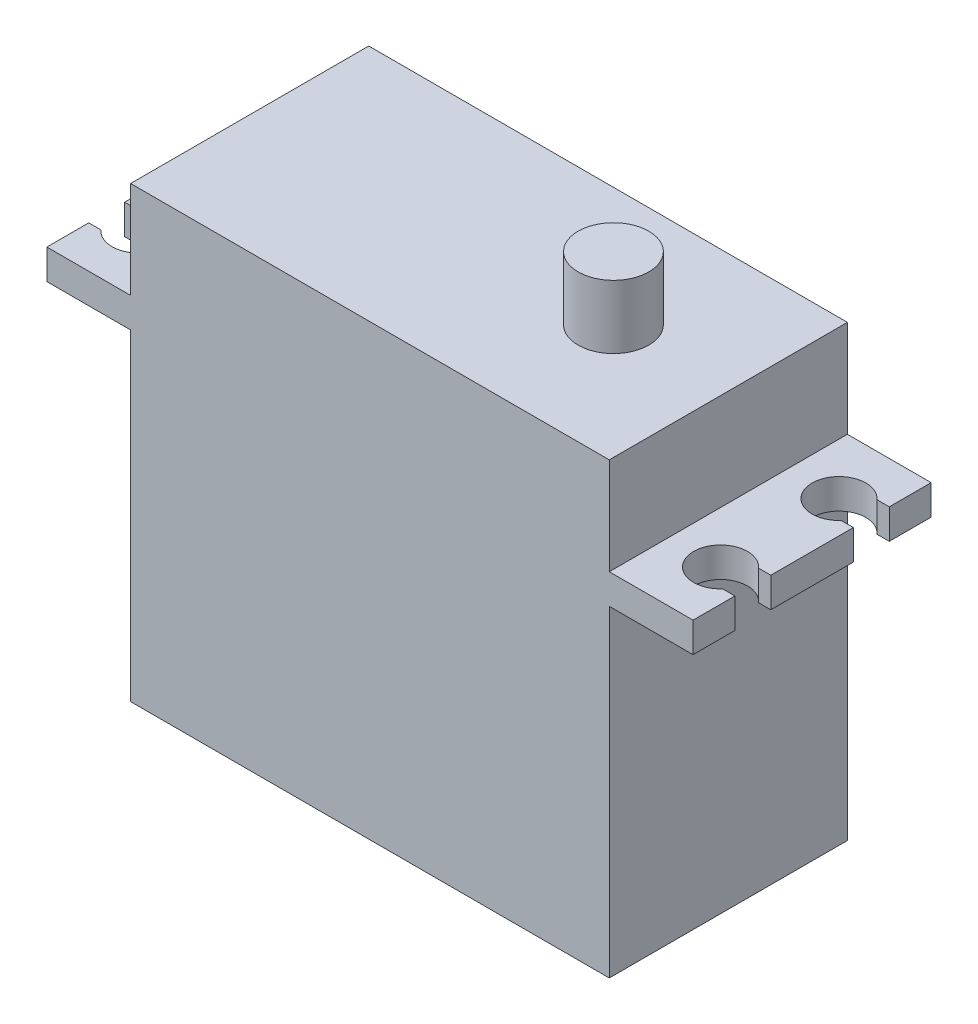
ISO-10303-21;
HEADER;
FILE_DESCRIPTION(('STEP AP214'),'2;1');
FILE_NAME('part.step','',(''),(''),'','','');
FILE_SCHEMA(('AUTOMOTIVE_DESIGN { 1 0 10303 214 1 1 1 1 }'));
ENDSEC;
DATA;
#1=APPLICATION_CONTEXT('core data for automotive mechanical design processes');
#2=APPLICATION_PROTOCOL_DEFINITION('international standard','automotive_design',2000,#1);
#3=PRODUCT_CONTEXT('',#1,'mechanical');
#4=PRODUCT('Part','Part','',(#3));
#5=PRODUCT_RELATED_PRODUCT_CATEGORY('part','',(#4));
#6=PRODUCT_DEFINITION_FORMATION('','',#4);
#7=PRODUCT_DEFINITION_CONTEXT('part definition',#1,'design');
#8=PRODUCT_DEFINITION('design','',#6,#7);
#9=PRODUCT_DEFINITION_SHAPE('','',#8);
#10=(LENGTH_UNIT() NAMED_UNIT(*) SI_UNIT(.MILLI.,.METRE.));
#11=(NAMED_UNIT(*) PLANE_ANGLE_UNIT() SI_UNIT($,.RADIAN.));
#12=(NAMED_UNIT(*) SI_UNIT($,.STERADIAN.) SOLID_ANGLE_UNIT());
#13=UNCERTAINTY_MEASURE_WITH_UNIT(LENGTH_MEASURE(1.E-05),#10,'distance_accuracy_value','');
#14=(GEOMETRIC_REPRESENTATION_CONTEXT(3) GLOBAL_UNCERTAINTY_ASSIGNED_CONTEXT((#13)) GLOBAL_UNIT_ASSIGNED_CONTEXT((#10,
#11,#12)) REPRESENTATION_CONTEXT('',''));
#15=CARTESIAN_POINT('',(0.,0.,0.));
#16=DIRECTION('',(0.,0.,1.));
#17=DIRECTION('',(1.,0.,0.));
#18=AXIS2_PLACEMENT_3D('',#15,#16,#17);
#19=CARTESIAN_POINT('',(10.4,42.8,0.));
#20=DIRECTION('',(0.,-1.,0.));
#21=DIRECTION('',(1.,0.,0.));
#22=AXIS2_PLACEMENT_3D('',#19,#20,#21);
#23=PLANE('',#22);
#24=CARTESIAN_POINT('',(10.4,42.8,0.));
#25=DIRECTION('',(0.,-1.,0.));
#26=DIRECTION('',(-1.,0.,0.));
#27=AXIS2_PLACEMENT_3D('',#24,#25,#26);
#28=CIRCLE('',#27,2.95);
#29=CARTESIAN_POINT('',(7.45,42.8,0.));
#30=VERTEX_POINT('',#29);
#31=EDGE_CURVE('E11',#30,#30,#28,.T.);
#32=ORIENTED_EDGE('',*,*,#31,.F.);
#33=EDGE_LOOP('',(#32));
#34=FACE_BOUND('',#33,.T.);
#35=ADVANCED_FACE('F51',(#34),#23,.F.);
#36=CARTESIAN_POINT('',(10.4,42.8,0.));
#37=DIRECTION('',(0.,1.,0.));
#38=DIRECTION('',(-1.,0.,0.));
#39=AXIS2_PLACEMENT_3D('',#36,#37,#38);
#40=CYLINDRICAL_SURFACE('',#39,2.95);
#41=ORIENTED_EDGE('',*,*,#31,.T.);
#42=EDGE_LOOP('',(#41));
#43=FACE_BOUND('',#42,.T.);
#44=CARTESIAN_POINT('',(10.4,25.,0.));
#45=DIRECTION('',(0.,-1.,0.));
#46=DIRECTION('',(-1.,0.,0.));
#47=AXIS2_PLACEMENT_3D('',#44,#45,#46);
#48=CIRCLE('',#47,2.95);
#49=CARTESIAN_POINT('',(7.45,25.,0.));
#50=VERTEX_POINT('',#49);
#51=EDGE_CURVE('E57',#50,#50,#48,.T.);
#52=ORIENTED_EDGE('',*,*,#51,.F.);
#53=EDGE_LOOP('',(#52));
#54=FACE_BOUND('',#53,.T.);
#55=ADVANCED_FACE('F83',(#43,#54),#40,.T.);
#56=CARTESIAN_POINT('',(13.35,25.,0.));
#57=DIRECTION('',(0.,-1.,0.));
#58=DIRECTION('',(1.,0.,0.));
#59=AXIS2_PLACEMENT_3D('',#56,#57,#58);
#60=PLANE('',#59);
#61=ORIENTED_EDGE('',*,*,#51,.T.);
#62=EDGE_LOOP('',(#61));
#63=FACE_BOUND('',#62,.T.);
#64=CARTESIAN_POINT('',(10.4,25.,0.));
#65=DIRECTION('',(0.,-1.,0.));
#66=DIRECTION('',(-1.,0.,0.));
#67=AXIS2_PLACEMENT_3D('',#64,#65,#66);
#68=CIRCLE('',#67,6.);
#69=CARTESIAN_POINT('',(4.4,25.,0.));
#70=VERTEX_POINT('',#69);
#71=EDGE_CURVE('E61',#70,#70,#68,.T.);
#72=ORIENTED_EDGE('',*,*,#71,.F.);
#73=EDGE_LOOP('',(#72));
#74=FACE_BOUND('',#73,.T.);
#75=ADVANCED_FACE('F75',(#63,#74),#60,.F.);
#76=CARTESIAN_POINT('',(10.4,42.8,0.));
#77=DIRECTION('',(0.,1.,0.));
#78=DIRECTION('',(-1.,0.,0.));
#79=AXIS2_PLACEMENT_3D('',#76,#77,#78);
#80=CYLINDRICAL_SURFACE('',#79,6.);
#81=ORIENTED_EDGE('',*,*,#71,.T.);
#82=EDGE_LOOP('',(#81));
#83=FACE_BOUND('',#82,.T.);
#84=CARTESIAN_POINT('',(10.4,3.,0.));
#85=DIRECTION('',(0.,-1.,0.));
#86=DIRECTION('',(-1.,0.,0.));
#87=AXIS2_PLACEMENT_3D('',#84,#85,#86);
#88=CIRCLE('',#87,6.);
#89=CARTESIAN_POINT('',(4.4,3.,0.));
#90=VERTEX_POINT('',#89);
#91=EDGE_CURVE('E65',#90,#90,#88,.T.);
#92=ORIENTED_EDGE('',*,*,#91,.F.);
#93=EDGE_LOOP('',(#92));
#94=FACE_BOUND('',#93,.T.);
#95=ADVANCED_FACE('F73',(#83,#94),#80,.T.);
#96=CARTESIAN_POINT('',(16.4,3.,0.));
#97=DIRECTION('',(0.,1.,0.));
#98=DIRECTION('',(-1.,0.,0.));
#99=AXIS2_PLACEMENT_3D('',#96,#97,#98);
#100=PLANE('',#99);
#101=ORIENTED_EDGE('',*,*,#91,.T.);
#102=EDGE_LOOP('',(#101));
#103=FACE_BOUND('',#102,.T.);
#104=ADVANCED_FACE('F71',(#103),#100,.F.);
#105=CLOSED_SHELL('',(#35,#55,#75,#95,#104));
#106=MANIFOLD_SOLID_BREP('B2',#105);
#107=CARTESIAN_POINT('',(-24.3,29.4,4.95));
#108=DIRECTION('',(0.,1.,0.));
#109=DIRECTION('',(0.,0.,-1.));
#110=AXIS2_PLACEMENT_3D('',#107,#108,#109);
#111=PLANE('',#110);
#112=DIRECTION('',(0.,0.,1.));
#113=VECTOR('',#112,1.);
#114=CARTESIAN_POINT('',(20.,29.4,-9.95));
#115=LINE('',#114,#113);
#116=CARTESIAN_POINT('',(20.,29.4,-9.95));
#117=VERTEX_POINT('',#116);
#118=CARTESIAN_POINT('',(20.,29.4,9.95));
#119=VERTEX_POINT('',#118);
#120=EDGE_CURVE('E543',#117,#119,#115,.T.);
#121=ORIENTED_EDGE('',*,*,#120,.T.);
#122=DIRECTION('',(-1.,0.,0.));
#123=VECTOR('',#122,1.);
#124=CARTESIAN_POINT('',(-27.,29.4,9.95));
#125=LINE('',#124,#123);
#126=CARTESIAN_POINT('',(27.,29.4,9.95));
#127=VERTEX_POINT('',#126);
#128=EDGE_CURVE('E328',#127,#119,#125,.T.);
#129=ORIENTED_EDGE('',*,*,#128,.F.);
#130=DIRECTION('',(0.,0.,1.));
#131=VECTOR('',#130,1.);
#132=CARTESIAN_POINT('',(27.,29.4,6.45));
#133=LINE('',#132,#131);
#134=CARTESIAN_POINT('',(27.,29.4,6.45));
#135=VERTEX_POINT('',#134);
#136=EDGE_CURVE('E339',#135,#127,#133,.T.);
#137=ORIENTED_EDGE('',*,*,#136,.F.);
#138=DIRECTION('',(1.,0.,0.));
#139=VECTOR('',#138,1.);
#140=CARTESIAN_POINT('',(25.9770509831248,29.4,6.45));
#141=LINE('',#140,#139);
#142=CARTESIAN_POINT('',(25.9770509831248,29.4,6.45));
#143=VERTEX_POINT('',#142);
#144=EDGE_CURVE('E396',#143,#135,#141,.T.);
#145=ORIENTED_EDGE('',*,*,#144,.F.);
#146=CARTESIAN_POINT('',(24.3,29.4,4.95));
#147=DIRECTION('',(0.,1.,0.));
#148=DIRECTION('',(0.,0.,-1.));
#149=AXIS2_PLACEMENT_3D('',#146,#147,#148);
#150=CIRCLE('',#149,2.25);
#151=CARTESIAN_POINT('',(25.9770509831248,29.4,3.45));
#152=VERTEX_POINT('',#151);
#153=EDGE_CURVE('E393',#152,#143,#150,.T.);
#154=ORIENTED_EDGE('',*,*,#153,.F.);
#155=DIRECTION('',(-1.,0.,0.));
#156=VECTOR('',#155,1.);
#157=CARTESIAN_POINT('',(25.9770509831248,29.4,3.45));
#158=LINE('',#157,#156);
#159=CARTESIAN_POINT('',(27.,29.4,3.45));
#160=VERTEX_POINT('',#159);
#161=EDGE_CURVE('E390',#160,#152,#158,.T.);
#162=ORIENTED_EDGE('',*,*,#161,.F.);
#163=DIRECTION('',(0.,0.,1.));
#164=VECTOR('',#163,1.);
#165=CARTESIAN_POINT('',(27.,29.4,-3.45));
#166=LINE('',#165,#164);
#167=CARTESIAN_POINT('',(27.,29.4,-3.45));
#168=VERTEX_POINT('',#167);
#169=EDGE_CURVE('E387',#168,#160,#166,.T.);
#170=ORIENTED_EDGE('',*,*,#169,.F.);
#171=DIRECTION('',(1.,0.,0.));
#172=VECTOR('',#171,1.);
#173=CARTESIAN_POINT('',(25.9770509831248,29.4,-3.45));
#174=LINE('',#173,#172);
#175=CARTESIAN_POINT('',(25.9770509831248,29.4,-3.45));
#176=VERTEX_POINT('',#175);
#177=EDGE_CURVE('E384',#176,#168,#174,.T.);
#178=ORIENTED_EDGE('',*,*,#177,.F.);
#179=CARTESIAN_POINT('',(24.3,29.4,-4.95));
#180=DIRECTION('',(0.,1.,0.));
#181=DIRECTION('',(0.,0.,-1.));
#182=AXIS2_PLACEMENT_3D('',#179,#180,#181);
#183=CIRCLE('',#182,2.25);
#184=CARTESIAN_POINT('',(25.9770509831248,29.4,-6.45));
#185=VERTEX_POINT('',#184);
#186=EDGE_CURVE('E381',#185,#176,#183,.T.);
#187=ORIENTED_EDGE('',*,*,#186,.F.);
#188=DIRECTION('',(-1.,0.,0.));
#189=VECTOR('',#188,1.);
#190=CARTESIAN_POINT('',(25.9770509831248,29.4,-6.45));
#191=LINE('',#190,#189);
#192=CARTESIAN_POINT('',(27.,29.4,-6.45));
#193=VERTEX_POINT('',#192);
#194=EDGE_CURVE('E378',#193,#185,#191,.T.);
#195=ORIENTED_EDGE('',*,*,#194,.F.);
#196=DIRECTION('',(0.,0.,1.));
#197=VECTOR('',#196,1.);
#198=CARTESIAN_POINT('',(27.,29.4,-9.95));
#199=LINE('',#198,#197);
#200=CARTESIAN_POINT('',(27.,29.4,-9.95));
#201=VERTEX_POINT('',#200);
#202=EDGE_CURVE('E375',#201,#193,#199,.T.);
#203=ORIENTED_EDGE('',*,*,#202,.F.);
#204=DIRECTION('',(1.,0.,0.));
#205=VECTOR('',#204,1.);
#206=CARTESIAN_POINT('',(-27.,29.4,-9.95));
#207=LINE('',#206,#205);
#208=EDGE_CURVE('E371',#117,#201,#207,.T.);
#209=ORIENTED_EDGE('',*,*,#208,.F.);
#210=EDGE_LOOP('',(#121,#129,#137,#145,#154,#162,#170,#178,#187,#195,#203,#209));
#211=FACE_BOUND('',#210,.T.);
#212=ADVANCED_FACE('F122',(#211),#111,.T.);
#213=CARTESIAN_POINT('',(20.,26.9,-9.95));
#214=DIRECTION('',(-1.,0.,0.));
#215=DIRECTION('',(0.,0.,-1.));
#216=AXIS2_PLACEMENT_3D('',#213,#214,#215);
#217=PLANE('',#216);
#218=DIRECTION('',(0.,0.,1.));
#219=VECTOR('',#218,1.);
#220=CARTESIAN_POINT('',(20.,0.,-9.95));
#221=LINE('',#220,#219);
#222=CARTESIAN_POINT('',(20.,0.,-9.95));
#223=VERTEX_POINT('',#222);
#224=CARTESIAN_POINT('',(20.,0.,9.95));
#225=VERTEX_POINT('',#224);
#226=EDGE_CURVE('E497',#223,#225,#221,.T.);
#227=ORIENTED_EDGE('',*,*,#226,.F.);
#228=DIRECTION('',(0.,-1.,0.));
#229=VECTOR('',#228,1.);
#230=CARTESIAN_POINT('',(20.,26.9,-9.95));
#231=LINE('',#230,#229);
#232=CARTESIAN_POINT('',(20.,26.9,-9.95));
#233=VERTEX_POINT('',#232);
#234=EDGE_CURVE('E505',#233,#223,#231,.T.);
#235=ORIENTED_EDGE('',*,*,#234,.F.);
#236=DIRECTION('',(0.,0.,1.));
#237=VECTOR('',#236,1.);
#238=CARTESIAN_POINT('',(20.,26.9,-9.95));
#239=LINE('',#238,#237);
#240=CARTESIAN_POINT('',(20.,26.9,9.95));
#241=VERTEX_POINT('',#240);
#242=EDGE_CURVE('E498',#233,#241,#239,.T.);
#243=ORIENTED_EDGE('',*,*,#242,.T.);
#244=DIRECTION('',(0.,-1.,0.));
#245=VECTOR('',#244,1.);
#246=CARTESIAN_POINT('',(20.,26.9,9.95));
#247=LINE('',#246,#245);
#248=EDGE_CURVE('E49',#241,#225,#247,.T.);
#249=ORIENTED_EDGE('',*,*,#248,.T.);
#250=EDGE_LOOP('',(#227,#235,#243,#249));
#251=FACE_BOUND('',#250,.T.);
#252=ADVANCED_FACE('F124',(#251),#217,.F.);
#253=CARTESIAN_POINT('',(-20.,26.9,9.95));
#254=DIRECTION('',(0.,0.,-1.));
#255=DIRECTION('',(1.,0.,0.));
#256=AXIS2_PLACEMENT_3D('',#253,#254,#255);
#257=PLANE('',#256);
#258=DIRECTION('',(-1.,0.,0.));
#259=VECTOR('',#258,1.);
#260=CARTESIAN_POINT('',(-20.,0.,9.95));
#261=LINE('',#260,#259);
#262=CARTESIAN_POINT('',(-20.,0.,9.95));
#263=VERTEX_POINT('',#262);
#264=EDGE_CURVE('E508',#225,#263,#261,.T.);
#265=ORIENTED_EDGE('',*,*,#264,.F.);
#266=ORIENTED_EDGE('',*,*,#248,.F.);
#267=DIRECTION('',(-1.,0.,0.));
#268=VECTOR('',#267,1.);
#269=CARTESIAN_POINT('',(-27.,26.9,9.95));
#270=LINE('',#269,#268);
#271=CARTESIAN_POINT('',(27.,26.9,9.95));
#272=VERTEX_POINT('',#271);
#273=EDGE_CURVE('E400',#272,#241,#270,.T.);
#274=ORIENTED_EDGE('',*,*,#273,.F.);
#275=DIRECTION('',(0.,-1.,0.));
#276=VECTOR('',#275,1.);
#277=CARTESIAN_POINT('',(27.,29.4,9.95));
#278=LINE('',#277,#276);
#279=EDGE_CURVE('E494',#127,#272,#278,.T.);
#280=ORIENTED_EDGE('',*,*,#279,.F.);
#281=ORIENTED_EDGE('',*,*,#128,.T.);
#282=DIRECTION('',(0.,-1.,0.));
#283=VECTOR('',#282,1.);
#284=CARTESIAN_POINT('',(20.,37.5,9.95));
#285=LINE('',#284,#283);
#286=CARTESIAN_POINT('',(20.,37.5,9.95));
#287=VERTEX_POINT('',#286);
#288=EDGE_CURVE('E314',#287,#119,#285,.T.);
#289=ORIENTED_EDGE('',*,*,#288,.F.);
#290=DIRECTION('',(-1.,0.,0.));
#291=VECTOR('',#290,1.);
#292=CARTESIAN_POINT('',(-20.,37.5,9.95));
#293=LINE('',#292,#291);
#294=CARTESIAN_POINT('',(-20.,37.5,9.95));
#295=VERTEX_POINT('',#294);
#296=EDGE_CURVE('E318',#287,#295,#293,.T.);
#297=ORIENTED_EDGE('',*,*,#296,.T.);
#298=DIRECTION('',(0.,-1.,0.));
#299=VECTOR('',#298,1.);
#300=CARTESIAN_POINT('',(-20.,37.5,9.95));
#301=LINE('',#300,#299);
#302=CARTESIAN_POINT('',(-20.,29.4,9.95));
#303=VERTEX_POINT('',#302);
#304=EDGE_CURVE('E331',#295,#303,#301,.T.);
#305=ORIENTED_EDGE('',*,*,#304,.T.);
#306=CARTESIAN_POINT('',(-27.,29.4,9.95));
#307=VERTEX_POINT('',#306);
#308=EDGE_CURVE('E342',#303,#307,#125,.T.);
#309=ORIENTED_EDGE('',*,*,#308,.T.);
#310=DIRECTION('',(0.,-1.,0.));
#311=VECTOR('',#310,1.);
#312=CARTESIAN_POINT('',(-27.,29.4,9.95));
#313=LINE('',#312,#311);
#314=CARTESIAN_POINT('',(-27.,26.9,9.95));
#315=VERTEX_POINT('',#314);
#316=EDGE_CURVE('E491',#307,#315,#313,.T.);
#317=ORIENTED_EDGE('',*,*,#316,.T.);
#318=CARTESIAN_POINT('',(-20.,26.9,9.95));
#319=VERTEX_POINT('',#318);
#320=EDGE_CURVE('E333',#319,#315,#270,.T.);
#321=ORIENTED_EDGE('',*,*,#320,.F.);
#322=DIRECTION('',(0.,-1.,0.));
#323=VECTOR('',#322,1.);
#324=CARTESIAN_POINT('',(-20.,26.9,9.95));
#325=LINE('',#324,#323);
#326=EDGE_CURVE('E131',#319,#263,#325,.T.);
#327=ORIENTED_EDGE('',*,*,#326,.T.);
#328=EDGE_LOOP('',(#265,#266,#274,#280,#281,#289,#297,#305,#309,#317,#321,#327));
#329=FACE_BOUND('',#328,.T.);
#330=ADVANCED_FACE('F326',(#329),#257,.F.);
#331=CARTESIAN_POINT('',(-20.,26.9,-9.95));
#332=DIRECTION('',(1.,0.,0.));
#333=DIRECTION('',(0.,0.,1.));
#334=AXIS2_PLACEMENT_3D('',#331,#332,#333);
#335=PLANE('',#334);
#336=DIRECTION('',(0.,0.,-1.));
#337=VECTOR('',#336,1.);
#338=CARTESIAN_POINT('',(-20.,0.,-9.95));
#339=LINE('',#338,#337);
#340=CARTESIAN_POINT('',(-20.,0.,-9.95));
#341=VERTEX_POINT('',#340);
#342=EDGE_CURVE('E511',#263,#341,#339,.T.);
#343=ORIENTED_EDGE('',*,*,#342,.F.);
#344=ORIENTED_EDGE('',*,*,#326,.F.);
#345=DIRECTION('',(0.,0.,-1.));
#346=VECTOR('',#345,1.);
#347=CARTESIAN_POINT('',(-20.,26.9,-9.95));
#348=LINE('',#347,#346);
#349=CARTESIAN_POINT('',(-20.,26.9,-9.95));
#350=VERTEX_POINT('',#349);
#351=EDGE_CURVE('E501',#319,#350,#348,.T.);
#352=ORIENTED_EDGE('',*,*,#351,.T.);
#353=DIRECTION('',(0.,-1.,0.));
#354=VECTOR('',#353,1.);
#355=CARTESIAN_POINT('',(-20.,26.9,-9.95));
#356=LINE('',#355,#354);
#357=EDGE_CURVE('E517',#350,#341,#356,.T.);
#358=ORIENTED_EDGE('',*,*,#357,.T.);
#359=EDGE_LOOP('',(#343,#344,#352,#358));
#360=FACE_BOUND('',#359,.T.);
#361=ADVANCED_FACE('F571',(#360),#335,.F.);
#362=CARTESIAN_POINT('',(-20.,26.9,-9.95));
#363=DIRECTION('',(0.,0.,1.));
#364=DIRECTION('',(-1.,0.,0.));
#365=AXIS2_PLACEMENT_3D('',#362,#363,#364);
#366=PLANE('',#365);
#367=DIRECTION('',(1.,0.,0.));
#368=VECTOR('',#367,1.);
#369=CARTESIAN_POINT('',(-20.,0.,-9.95));
#370=LINE('',#369,#368);
#371=EDGE_CURVE('E502',#341,#223,#370,.T.);
#372=ORIENTED_EDGE('',*,*,#371,.F.);
#373=ORIENTED_EDGE('',*,*,#357,.F.);
#374=DIRECTION('',(1.,0.,0.));
#375=VECTOR('',#374,1.);
#376=CARTESIAN_POINT('',(-27.,26.9,-9.95));
#377=LINE('',#376,#375);
#378=CARTESIAN_POINT('',(-27.,26.9,-9.95));
#379=VERTEX_POINT('',#378);
#380=EDGE_CURVE('E429',#379,#350,#377,.T.);
#381=ORIENTED_EDGE('',*,*,#380,.F.);
#382=DIRECTION('',(0.,-1.,0.));
#383=VECTOR('',#382,1.);
#384=CARTESIAN_POINT('',(-27.,29.4,-9.95));
#385=LINE('',#384,#383);
#386=CARTESIAN_POINT('',(-27.,29.4,-9.95));
#387=VERTEX_POINT('',#386);
#388=EDGE_CURVE('E472',#387,#379,#385,.T.);
#389=ORIENTED_EDGE('',*,*,#388,.F.);
#390=CARTESIAN_POINT('',(-20.,29.4,-9.95));
#391=VERTEX_POINT('',#390);
#392=EDGE_CURVE('E372',#387,#391,#207,.T.);
#393=ORIENTED_EDGE('',*,*,#392,.T.);
#394=DIRECTION('',(0.,-1.,0.));
#395=VECTOR('',#394,1.);
#396=CARTESIAN_POINT('',(-20.,37.5,-9.95));
#397=LINE('',#396,#395);
#398=CARTESIAN_POINT('',(-20.,37.5,-9.95));
#399=VERTEX_POINT('',#398);
#400=EDGE_CURVE('E335',#399,#391,#397,.T.);
#401=ORIENTED_EDGE('',*,*,#400,.F.);
#402=DIRECTION('',(1.,0.,0.));
#403=VECTOR('',#402,1.);
#404=CARTESIAN_POINT('',(-20.,37.5,-9.95));
#405=LINE('',#404,#403);
#406=CARTESIAN_POINT('',(20.,37.5,-9.95));
#407=VERTEX_POINT('',#406);
#408=EDGE_CURVE('E550',#399,#407,#405,.T.);
#409=ORIENTED_EDGE('',*,*,#408,.T.);
#410=DIRECTION('',(0.,-1.,0.));
#411=VECTOR('',#410,1.);
#412=CARTESIAN_POINT('',(20.,37.5,-9.95));
#413=LINE('',#412,#411);
#414=EDGE_CURVE('E138',#407,#117,#413,.T.);
#415=ORIENTED_EDGE('',*,*,#414,.T.);
#416=ORIENTED_EDGE('',*,*,#208,.T.);
#417=DIRECTION('',(0.,-1.,0.));
#418=VECTOR('',#417,1.);
#419=CARTESIAN_POINT('',(27.,29.4,-9.95));
#420=LINE('',#419,#418);
#421=CARTESIAN_POINT('',(27.,26.9,-9.95));
#422=VERTEX_POINT('',#421);
#423=EDGE_CURVE('E469',#201,#422,#420,.T.);
#424=ORIENTED_EDGE('',*,*,#423,.T.);
#425=EDGE_CURVE('E428',#233,#422,#377,.T.);
#426=ORIENTED_EDGE('',*,*,#425,.F.);
#427=ORIENTED_EDGE('',*,*,#234,.T.);
#428=EDGE_LOOP('',(#372,#373,#381,#389,#393,#401,#409,#415,#416,#424,#426,#427));
#429=FACE_BOUND('',#428,.T.);
#430=ADVANCED_FACE('F557',(#429),#366,.F.);
#431=CARTESIAN_POINT('',(0.,0.,0.));
#432=DIRECTION('',(0.,-1.,0.));
#433=DIRECTION('',(0.,0.,1.));
#434=AXIS2_PLACEMENT_3D('',#431,#432,#433);
#435=PLANE('',#434);
#436=ORIENTED_EDGE('',*,*,#226,.T.);
#437=ORIENTED_EDGE('',*,*,#264,.T.);
#438=ORIENTED_EDGE('',*,*,#342,.T.);
#439=ORIENTED_EDGE('',*,*,#371,.T.);
#440=EDGE_LOOP('',(#436,#437,#438,#439));
#441=FACE_BOUND('',#440,.T.);
#442=ADVANCED_FACE('F527',(#441),#435,.T.);
#443=CARTESIAN_POINT('',(-24.3,26.9,4.95));
#444=DIRECTION('',(0.,1.,0.));
#445=DIRECTION('',(0.,0.,-1.));
#446=AXIS2_PLACEMENT_3D('',#443,#444,#445);
#447=PLANE('',#446);
#448=ORIENTED_EDGE('',*,*,#425,.T.);
#449=DIRECTION('',(0.,0.,1.));
#450=VECTOR('',#449,1.);
#451=CARTESIAN_POINT('',(27.,26.9,-9.95));
#452=LINE('',#451,#450);
#453=CARTESIAN_POINT('',(27.,26.9,-6.45));
#454=VERTEX_POINT('',#453);
#455=EDGE_CURVE('E431',#422,#454,#452,.T.);
#456=ORIENTED_EDGE('',*,*,#455,.T.);
#457=DIRECTION('',(-1.,0.,0.));
#458=VECTOR('',#457,1.);
#459=CARTESIAN_POINT('',(25.9770509831248,26.9,-6.45));
#460=LINE('',#459,#458);
#461=CARTESIAN_POINT('',(25.9770509831248,26.9,-6.45));
#462=VERTEX_POINT('',#461);
#463=EDGE_CURVE('E434',#454,#462,#460,.T.);
#464=ORIENTED_EDGE('',*,*,#463,.T.);
#465=CARTESIAN_POINT('',(24.3,26.9,-4.95));
#466=DIRECTION('',(0.,1.,0.));
#467=DIRECTION('',(0.,0.,-1.));
#468=AXIS2_PLACEMENT_3D('',#465,#466,#467);
#469=CIRCLE('',#468,2.25);
#470=CARTESIAN_POINT('',(25.9770509831248,26.9,-3.45));
#471=VERTEX_POINT('',#470);
#472=EDGE_CURVE('E437',#462,#471,#469,.T.);
#473=ORIENTED_EDGE('',*,*,#472,.T.);
#474=DIRECTION('',(1.,0.,0.));
#475=VECTOR('',#474,1.);
#476=CARTESIAN_POINT('',(25.9770509831248,26.9,-3.45));
#477=LINE('',#476,#475);
#478=CARTESIAN_POINT('',(27.,26.9,-3.45));
#479=VERTEX_POINT('',#478);
#480=EDGE_CURVE('E440',#471,#479,#477,.T.);
#481=ORIENTED_EDGE('',*,*,#480,.T.);
#482=DIRECTION('',(0.,0.,1.));
#483=VECTOR('',#482,1.);
#484=CARTESIAN_POINT('',(27.,26.9,-3.45));
#485=LINE('',#484,#483);
#486=CARTESIAN_POINT('',(27.,26.9,3.45));
#487=VERTEX_POINT('',#486);
#488=EDGE_CURVE('E443',#479,#487,#485,.T.);
#489=ORIENTED_EDGE('',*,*,#488,.T.);
#490=DIRECTION('',(-1.,0.,0.));
#491=VECTOR('',#490,1.);
#492=CARTESIAN_POINT('',(25.9770509831248,26.9,3.45));
#493=LINE('',#492,#491);
#494=CARTESIAN_POINT('',(25.9770509831248,26.9,3.45));
#495=VERTEX_POINT('',#494);
#496=EDGE_CURVE('E446',#487,#495,#493,.T.);
#497=ORIENTED_EDGE('',*,*,#496,.T.);
#498=CARTESIAN_POINT('',(24.3,26.9,4.95));
#499=DIRECTION('',(0.,1.,0.));
#500=DIRECTION('',(0.,0.,-1.));
#501=AXIS2_PLACEMENT_3D('',#498,#499,#500);
#502=CIRCLE('',#501,2.25);
#503=CARTESIAN_POINT('',(25.9770509831248,26.9,6.45));
#504=VERTEX_POINT('',#503);
#505=EDGE_CURVE('E449',#495,#504,#502,.T.);
#506=ORIENTED_EDGE('',*,*,#505,.T.);
#507=DIRECTION('',(1.,0.,0.));
#508=VECTOR('',#507,1.);
#509=CARTESIAN_POINT('',(25.9770509831248,26.9,6.45));
#510=LINE('',#509,#508);
#511=CARTESIAN_POINT('',(27.,26.9,6.45));
#512=VERTEX_POINT('',#511);
#513=EDGE_CURVE('E343',#504,#512,#510,.T.);
#514=ORIENTED_EDGE('',*,*,#513,.T.);
#515=DIRECTION('',(0.,0.,1.));
#516=VECTOR('',#515,1.);
#517=CARTESIAN_POINT('',(27.,26.9,6.45));
#518=LINE('',#517,#516);
#519=EDGE_CURVE('E330',#512,#272,#518,.T.);
#520=ORIENTED_EDGE('',*,*,#519,.T.);
#521=ORIENTED_EDGE('',*,*,#273,.T.);
#522=ORIENTED_EDGE('',*,*,#242,.F.);
#523=EDGE_LOOP('',(#448,#456,#464,#473,#481,#489,#497,#506,#514,#520,#521,#522));
#524=FACE_BOUND('',#523,.T.);
#525=ADVANCED_FACE('F535',(#524),#447,.F.);
#526=ORIENTED_EDGE('',*,*,#320,.T.);
#527=DIRECTION('',(0.,0.,-1.));
#528=VECTOR('',#527,1.);
#529=CARTESIAN_POINT('',(-27.,26.9,6.45));
#530=LINE('',#529,#528);
#531=CARTESIAN_POINT('',(-27.,26.9,6.45));
#532=VERTEX_POINT('',#531);
#533=EDGE_CURVE('E402',#315,#532,#530,.T.);
#534=ORIENTED_EDGE('',*,*,#533,.T.);
#535=DIRECTION('',(1.,0.,0.));
#536=VECTOR('',#535,1.);
#537=CARTESIAN_POINT('',(-25.9770509831249,26.9,6.45));
#538=LINE('',#537,#536);
#539=CARTESIAN_POINT('',(-25.9770509831249,26.9,6.45));
#540=VERTEX_POINT('',#539);
#541=EDGE_CURVE('E405',#532,#540,#538,.T.);
#542=ORIENTED_EDGE('',*,*,#541,.T.);
#543=CARTESIAN_POINT('',(-24.3,26.9,4.95));
#544=DIRECTION('',(0.,1.,0.));
#545=DIRECTION('',(0.,0.,-1.));
#546=AXIS2_PLACEMENT_3D('',#543,#544,#545);
#547=CIRCLE('',#546,2.25);
#548=CARTESIAN_POINT('',(-25.9770509831249,26.9,3.45000000000001));
#549=VERTEX_POINT('',#548);
#550=EDGE_CURVE('E408',#540,#549,#547,.T.);
#551=ORIENTED_EDGE('',*,*,#550,.T.);
#552=DIRECTION('',(-1.,0.,0.));
#553=VECTOR('',#552,1.);
#554=CARTESIAN_POINT('',(-25.9770509831249,26.9,3.45000000000001));
#555=LINE('',#554,#553);
#556=CARTESIAN_POINT('',(-27.,26.9,3.45000000000001));
#557=VERTEX_POINT('',#556);
#558=EDGE_CURVE('E411',#549,#557,#555,.T.);
#559=ORIENTED_EDGE('',*,*,#558,.T.);
#560=DIRECTION('',(0.,0.,-1.));
#561=VECTOR('',#560,1.);
#562=CARTESIAN_POINT('',(-27.,26.9,-3.45));
#563=LINE('',#562,#561);
#564=CARTESIAN_POINT('',(-27.,26.9,-3.45));
#565=VERTEX_POINT('',#564);
#566=EDGE_CURVE('E414',#557,#565,#563,.T.);
#567=ORIENTED_EDGE('',*,*,#566,.T.);
#568=DIRECTION('',(1.,0.,0.));
#569=VECTOR('',#568,1.);
#570=CARTESIAN_POINT('',(-25.9770509831249,26.9,-3.45));
#571=LINE('',#570,#569);
#572=CARTESIAN_POINT('',(-25.9770509831249,26.9,-3.45));
#573=VERTEX_POINT('',#572);
#574=EDGE_CURVE('E417',#565,#573,#571,.T.);
#575=ORIENTED_EDGE('',*,*,#574,.T.);
#576=CARTESIAN_POINT('',(-24.3,26.9,-4.95));
#577=DIRECTION('',(0.,1.,0.));
#578=DIRECTION('',(0.,0.,-1.));
#579=AXIS2_PLACEMENT_3D('',#576,#577,#578);
#580=CIRCLE('',#579,2.25);
#581=CARTESIAN_POINT('',(-25.9770509831249,26.9,-6.45));
#582=VERTEX_POINT('',#581);
#583=EDGE_CURVE('E420',#573,#582,#580,.T.);
#584=ORIENTED_EDGE('',*,*,#583,.T.);
#585=DIRECTION('',(-1.,0.,0.));
#586=VECTOR('',#585,1.);
#587=CARTESIAN_POINT('',(-25.9770509831249,26.9,-6.45));
#588=LINE('',#587,#586);
#589=CARTESIAN_POINT('',(-27.,26.9,-6.45));
#590=VERTEX_POINT('',#589);
#591=EDGE_CURVE('E423',#582,#590,#588,.T.);
#592=ORIENTED_EDGE('',*,*,#591,.T.);
#593=DIRECTION('',(0.,0.,-1.));
#594=VECTOR('',#593,1.);
#595=CARTESIAN_POINT('',(-27.,26.9,-9.95));
#596=LINE('',#595,#594);
#597=EDGE_CURVE('E426',#590,#379,#596,.T.);
#598=ORIENTED_EDGE('',*,*,#597,.T.);
#599=ORIENTED_EDGE('',*,*,#380,.T.);
#600=ORIENTED_EDGE('',*,*,#351,.F.);
#601=EDGE_LOOP('',(#526,#534,#542,#551,#559,#567,#575,#584,#592,#598,#599,#600));
#602=FACE_BOUND('',#601,.T.);
#603=ADVANCED_FACE('F569',(#602),#447,.F.);
#604=CARTESIAN_POINT('',(27.,29.4,6.45));
#605=DIRECTION('',(-1.,0.,0.));
#606=DIRECTION('',(0.,0.,-1.));
#607=AXIS2_PLACEMENT_3D('',#604,#605,#606);
#608=PLANE('',#607);
#609=ORIENTED_EDGE('',*,*,#519,.F.);
#610=DIRECTION('',(0.,-1.,0.));
#611=VECTOR('',#610,1.);
#612=CARTESIAN_POINT('',(27.,29.4,6.45));
#613=LINE('',#612,#611);
#614=EDGE_CURVE('E398',#135,#512,#613,.T.);
#615=ORIENTED_EDGE('',*,*,#614,.F.);
#616=ORIENTED_EDGE('',*,*,#136,.T.);
#617=ORIENTED_EDGE('',*,*,#279,.T.);
#618=EDGE_LOOP('',(#609,#615,#616,#617));
#619=FACE_BOUND('',#618,.T.);
#620=ADVANCED_FACE('F539',(#619),#608,.F.);
#621=CARTESIAN_POINT('',(-27.,29.4,6.45));
#622=DIRECTION('',(1.,0.,0.));
#623=DIRECTION('',(0.,0.,1.));
#624=AXIS2_PLACEMENT_3D('',#621,#622,#623);
#625=PLANE('',#624);
#626=ORIENTED_EDGE('',*,*,#533,.F.);
#627=ORIENTED_EDGE('',*,*,#316,.F.);
#628=DIRECTION('',(0.,0.,-1.));
#629=VECTOR('',#628,1.);
#630=CARTESIAN_POINT('',(-27.,29.4,6.45));
#631=LINE('',#630,#629);
#632=CARTESIAN_POINT('',(-27.,29.4,6.45));
#633=VERTEX_POINT('',#632);
#634=EDGE_CURVE('E345',#307,#633,#631,.T.);
#635=ORIENTED_EDGE('',*,*,#634,.T.);
#636=DIRECTION('',(0.,-1.,0.));
#637=VECTOR('',#636,1.);
#638=CARTESIAN_POINT('',(-27.,29.4,6.45));
#639=LINE('',#638,#637);
#640=EDGE_CURVE('E489',#633,#532,#639,.T.);
#641=ORIENTED_EDGE('',*,*,#640,.T.);
#642=EDGE_LOOP('',(#626,#627,#635,#641));
#643=FACE_BOUND('',#642,.T.);
#644=ADVANCED_FACE('F565',(#643),#625,.F.);
#645=CARTESIAN_POINT('',(-25.9770509831249,29.4,6.45));
#646=DIRECTION('',(0.,0.,1.));
#647=DIRECTION('',(-1.,0.,0.));
#648=AXIS2_PLACEMENT_3D('',#645,#646,#647);
#649=PLANE('',#648);
#650=ORIENTED_EDGE('',*,*,#541,.F.);
#651=ORIENTED_EDGE('',*,*,#640,.F.);
#652=DIRECTION('',(1.,0.,0.));
#653=VECTOR('',#652,1.);
#654=CARTESIAN_POINT('',(-25.9770509831249,29.4,6.45));
#655=LINE('',#654,#653);
#656=CARTESIAN_POINT('',(-25.9770509831249,29.4,6.45));
#657=VERTEX_POINT('',#656);
#658=EDGE_CURVE('E348',#633,#657,#655,.T.);
#659=ORIENTED_EDGE('',*,*,#658,.T.);
#660=DIRECTION('',(0.,-1.,0.));
#661=VECTOR('',#660,1.);
#662=CARTESIAN_POINT('',(-25.9770509831249,29.4,6.45));
#663=LINE('',#662,#661);
#664=EDGE_CURVE('E487',#657,#540,#663,.T.);
#665=ORIENTED_EDGE('',*,*,#664,.T.);
#666=EDGE_LOOP('',(#650,#651,#659,#665));
#667=FACE_BOUND('',#666,.T.);
#668=ADVANCED_FACE('F678',(#667),#649,.F.);
#669=CARTESIAN_POINT('',(-24.3,29.4,4.95));
#670=DIRECTION('',(0.,-1.,0.));
#671=DIRECTION('',(0.,0.,1.));
#672=AXIS2_PLACEMENT_3D('',#669,#670,#671);
#673=CYLINDRICAL_SURFACE('',#672,2.25);
#674=ORIENTED_EDGE('',*,*,#550,.F.);
#675=ORIENTED_EDGE('',*,*,#664,.F.);
#676=CARTESIAN_POINT('',(-24.3,29.4,4.95));
#677=DIRECTION('',(0.,1.,0.));
#678=DIRECTION('',(0.,0.,-1.));
#679=AXIS2_PLACEMENT_3D('',#676,#677,#678);
#680=CIRCLE('',#679,2.25);
#681=CARTESIAN_POINT('',(-25.9770509831249,29.4,3.45000000000001));
#682=VERTEX_POINT('',#681);
#683=EDGE_CURVE('E351',#657,#682,#680,.T.);
#684=ORIENTED_EDGE('',*,*,#683,.T.);
#685=DIRECTION('',(0.,-1.,0.));
#686=VECTOR('',#685,1.);
#687=CARTESIAN_POINT('',(-25.9770509831249,29.4,3.45000000000001));
#688=LINE('',#687,#686);
#689=EDGE_CURVE('E485',#682,#549,#688,.T.);
#690=ORIENTED_EDGE('',*,*,#689,.T.);
#691=EDGE_LOOP('',(#674,#675,#684,#690));
#692=FACE_BOUND('',#691,.T.);
#693=ADVANCED_FACE('F686',(#692),#673,.F.);
#694=CARTESIAN_POINT('',(-25.9770509831249,29.4,3.45000000000001));
#695=DIRECTION('',(0.,0.,-1.));
#696=DIRECTION('',(1.,0.,0.));
#697=AXIS2_PLACEMENT_3D('',#694,#695,#696);
#698=PLANE('',#697);
#699=ORIENTED_EDGE('',*,*,#558,.F.);
#700=ORIENTED_EDGE('',*,*,#689,.F.);
#701=DIRECTION('',(-1.,0.,0.));
#702=VECTOR('',#701,1.);
#703=CARTESIAN_POINT('',(-25.9770509831249,29.4,3.45000000000001));
#704=LINE('',#703,#702);
#705=CARTESIAN_POINT('',(-27.,29.4,3.45000000000001));
#706=VERTEX_POINT('',#705);
#707=EDGE_CURVE('E354',#682,#706,#704,.T.);
#708=ORIENTED_EDGE('',*,*,#707,.T.);
#709=DIRECTION('',(0.,-1.,0.));
#710=VECTOR('',#709,1.);
#711=CARTESIAN_POINT('',(-27.,29.4,3.45000000000001));
#712=LINE('',#711,#710);
#713=EDGE_CURVE('E483',#706,#557,#712,.T.);
#714=ORIENTED_EDGE('',*,*,#713,.T.);
#715=EDGE_LOOP('',(#699,#700,#708,#714));
#716=FACE_BOUND('',#715,.T.);
#717=ADVANCED_FACE('F696',(#716),#698,.F.);
#718=CARTESIAN_POINT('',(-27.,29.4,-3.45));
#719=DIRECTION('',(1.,0.,0.));
#720=DIRECTION('',(0.,0.,1.));
#721=AXIS2_PLACEMENT_3D('',#718,#719,#720);
#722=PLANE('',#721);
#723=ORIENTED_EDGE('',*,*,#566,.F.);
#724=ORIENTED_EDGE('',*,*,#713,.F.);
#725=DIRECTION('',(0.,0.,-1.));
#726=VECTOR('',#725,1.);
#727=CARTESIAN_POINT('',(-27.,29.4,-3.45));
#728=LINE('',#727,#726);
#729=CARTESIAN_POINT('',(-27.,29.4,-3.45));
#730=VERTEX_POINT('',#729);
#731=EDGE_CURVE('E357',#706,#730,#728,.T.);
#732=ORIENTED_EDGE('',*,*,#731,.T.);
#733=DIRECTION('',(0.,-1.,0.));
#734=VECTOR('',#733,1.);
#735=CARTESIAN_POINT('',(-27.,29.4,-3.45));
#736=LINE('',#735,#734);
#737=EDGE_CURVE('E481',#730,#565,#736,.T.);
#738=ORIENTED_EDGE('',*,*,#737,.T.);
#739=EDGE_LOOP('',(#723,#724,#732,#738));
#740=FACE_BOUND('',#739,.T.);
#741=ADVANCED_FACE('F706',(#740),#722,.F.);
#742=CARTESIAN_POINT('',(-25.9770509831249,29.4,-3.45));
#743=DIRECTION('',(0.,0.,1.));
#744=DIRECTION('',(-1.,0.,0.));
#745=AXIS2_PLACEMENT_3D('',#742,#743,#744);
#746=PLANE('',#745);
#747=ORIENTED_EDGE('',*,*,#574,.F.);
#748=ORIENTED_EDGE('',*,*,#737,.F.);
#749=DIRECTION('',(1.,0.,0.));
#750=VECTOR('',#749,1.);
#751=CARTESIAN_POINT('',(-25.9770509831249,29.4,-3.45));
#752=LINE('',#751,#750);
#753=CARTESIAN_POINT('',(-25.9770509831249,29.4,-3.45));
#754=VERTEX_POINT('',#753);
#755=EDGE_CURVE('E360',#730,#754,#752,.T.);
#756=ORIENTED_EDGE('',*,*,#755,.T.);
#757=DIRECTION('',(0.,-1.,0.));
#758=VECTOR('',#757,1.);
#759=CARTESIAN_POINT('',(-25.9770509831249,29.4,-3.45));
#760=LINE('',#759,#758);
#761=EDGE_CURVE('E479',#754,#573,#760,.T.);
#762=ORIENTED_EDGE('',*,*,#761,.T.);
#763=EDGE_LOOP('',(#747,#748,#756,#762));
#764=FACE_BOUND('',#763,.T.);
#765=ADVANCED_FACE('F716',(#764),#746,.F.);
#766=CARTESIAN_POINT('',(-24.3,29.4,-4.95));
#767=DIRECTION('',(0.,-1.,0.));
#768=DIRECTION('',(0.,0.,1.));
#769=AXIS2_PLACEMENT_3D('',#766,#767,#768);
#770=CYLINDRICAL_SURFACE('',#769,2.25);
#771=ORIENTED_EDGE('',*,*,#583,.F.);
#772=ORIENTED_EDGE('',*,*,#761,.F.);
#773=CARTESIAN_POINT('',(-24.3,29.4,-4.95));
#774=DIRECTION('',(0.,1.,0.));
#775=DIRECTION('',(0.,0.,-1.));
#776=AXIS2_PLACEMENT_3D('',#773,#774,#775);
#777=CIRCLE('',#776,2.25);
#778=CARTESIAN_POINT('',(-25.9770509831249,29.4,-6.45));
#779=VERTEX_POINT('',#778);
#780=EDGE_CURVE('E363',#754,#779,#777,.T.);
#781=ORIENTED_EDGE('',*,*,#780,.T.);
#782=DIRECTION('',(0.,-1.,0.));
#783=VECTOR('',#782,1.);
#784=CARTESIAN_POINT('',(-25.9770509831249,29.4,-6.45));
#785=LINE('',#784,#783);
#786=EDGE_CURVE('E477',#779,#582,#785,.T.);
#787=ORIENTED_EDGE('',*,*,#786,.T.);
#788=EDGE_LOOP('',(#771,#772,#781,#787));
#789=FACE_BOUND('',#788,.T.);
#790=ADVANCED_FACE('F726',(#789),#770,.F.);
#791=CARTESIAN_POINT('',(-25.9770509831249,29.4,-6.45));
#792=DIRECTION('',(0.,0.,-1.));
#793=DIRECTION('',(1.,0.,0.));
#794=AXIS2_PLACEMENT_3D('',#791,#792,#793);
#795=PLANE('',#794);
#796=ORIENTED_EDGE('',*,*,#591,.F.);
#797=ORIENTED_EDGE('',*,*,#786,.F.);
#798=DIRECTION('',(-1.,0.,0.));
#799=VECTOR('',#798,1.);
#800=CARTESIAN_POINT('',(-25.9770509831249,29.4,-6.45));
#801=LINE('',#800,#799);
#802=CARTESIAN_POINT('',(-27.,29.4,-6.45));
#803=VERTEX_POINT('',#802);
#804=EDGE_CURVE('E366',#779,#803,#801,.T.);
#805=ORIENTED_EDGE('',*,*,#804,.T.);
#806=DIRECTION('',(0.,-1.,0.));
#807=VECTOR('',#806,1.);
#808=CARTESIAN_POINT('',(-27.,29.4,-6.45));
#809=LINE('',#808,#807);
#810=EDGE_CURVE('E475',#803,#590,#809,.T.);
#811=ORIENTED_EDGE('',*,*,#810,.T.);
#812=EDGE_LOOP('',(#796,#797,#805,#811));
#813=FACE_BOUND('',#812,.T.);
#814=ADVANCED_FACE('F736',(#813),#795,.F.);
#815=CARTESIAN_POINT('',(-27.,29.4,-9.95));
#816=DIRECTION('',(1.,0.,0.));
#817=DIRECTION('',(0.,0.,1.));
#818=AXIS2_PLACEMENT_3D('',#815,#816,#817);
#819=PLANE('',#818);
#820=ORIENTED_EDGE('',*,*,#597,.F.);
#821=ORIENTED_EDGE('',*,*,#810,.F.);
#822=DIRECTION('',(0.,0.,-1.));
#823=VECTOR('',#822,1.);
#824=CARTESIAN_POINT('',(-27.,29.4,-9.95));
#825=LINE('',#824,#823);
#826=EDGE_CURVE('E369',#803,#387,#825,.T.);
#827=ORIENTED_EDGE('',*,*,#826,.T.);
#828=ORIENTED_EDGE('',*,*,#388,.T.);
#829=EDGE_LOOP('',(#820,#821,#827,#828));
#830=FACE_BOUND('',#829,.T.);
#831=ADVANCED_FACE('F746',(#830),#819,.F.);
#832=CARTESIAN_POINT('',(27.,29.4,-9.95));
#833=DIRECTION('',(-1.,0.,0.));
#834=DIRECTION('',(0.,0.,-1.));
#835=AXIS2_PLACEMENT_3D('',#832,#833,#834);
#836=PLANE('',#835);
#837=ORIENTED_EDGE('',*,*,#455,.F.);
#838=ORIENTED_EDGE('',*,*,#423,.F.);
#839=ORIENTED_EDGE('',*,*,#202,.T.);
#840=DIRECTION('',(0.,-1.,0.));
#841=VECTOR('',#840,1.);
#842=CARTESIAN_POINT('',(27.,29.4,-6.45));
#843=LINE('',#842,#841);
#844=EDGE_CURVE('E467',#193,#454,#843,.T.);
#845=ORIENTED_EDGE('',*,*,#844,.T.);
#846=EDGE_LOOP('',(#837,#838,#839,#845));
#847=FACE_BOUND('',#846,.T.);
#848=ADVANCED_FACE('F574',(#847),#836,.F.);
#849=CARTESIAN_POINT('',(25.9770509831248,29.4,-6.45));
#850=DIRECTION('',(0.,0.,-1.));
#851=DIRECTION('',(1.,0.,0.));
#852=AXIS2_PLACEMENT_3D('',#849,#850,#851);
#853=PLANE('',#852);
#854=ORIENTED_EDGE('',*,*,#463,.F.);
#855=ORIENTED_EDGE('',*,*,#844,.F.);
#856=ORIENTED_EDGE('',*,*,#194,.T.);
#857=DIRECTION('',(0.,-1.,0.));
#858=VECTOR('',#857,1.);
#859=CARTESIAN_POINT('',(25.9770509831248,29.4,-6.45));
#860=LINE('',#859,#858);
#861=EDGE_CURVE('E465',#185,#462,#860,.T.);
#862=ORIENTED_EDGE('',*,*,#861,.T.);
#863=EDGE_LOOP('',(#854,#855,#856,#862));
#864=FACE_BOUND('',#863,.T.);
#865=ADVANCED_FACE('F577',(#864),#853,.F.);
#866=CARTESIAN_POINT('',(24.3,29.4,-4.95));
#867=DIRECTION('',(0.,-1.,0.));
#868=DIRECTION('',(0.,0.,1.));
#869=AXIS2_PLACEMENT_3D('',#866,#867,#868);
#870=CYLINDRICAL_SURFACE('',#869,2.25);
#871=ORIENTED_EDGE('',*,*,#472,.F.);
#872=ORIENTED_EDGE('',*,*,#861,.F.);
#873=ORIENTED_EDGE('',*,*,#186,.T.);
#874=DIRECTION('',(0.,-1.,0.));
#875=VECTOR('',#874,1.);
#876=CARTESIAN_POINT('',(25.9770509831248,29.4,-3.45));
#877=LINE('',#876,#875);
#878=EDGE_CURVE('E463',#176,#471,#877,.T.);
#879=ORIENTED_EDGE('',*,*,#878,.T.);
#880=EDGE_LOOP('',(#871,#872,#873,#879));
#881=FACE_BOUND('',#880,.T.);
#882=ADVANCED_FACE('F581',(#881),#870,.F.);
#883=CARTESIAN_POINT('',(25.9770509831248,29.4,-3.45));
#884=DIRECTION('',(0.,0.,1.));
#885=DIRECTION('',(-1.,0.,0.));
#886=AXIS2_PLACEMENT_3D('',#883,#884,#885);
#887=PLANE('',#886);
#888=ORIENTED_EDGE('',*,*,#480,.F.);
#889=ORIENTED_EDGE('',*,*,#878,.F.);
#890=ORIENTED_EDGE('',*,*,#177,.T.);
#891=DIRECTION('',(0.,-1.,0.));
#892=VECTOR('',#891,1.);
#893=CARTESIAN_POINT('',(27.,29.4,-3.45));
#894=LINE('',#893,#892);
#895=EDGE_CURVE('E461',#168,#479,#894,.T.);
#896=ORIENTED_EDGE('',*,*,#895,.T.);
#897=EDGE_LOOP('',(#888,#889,#890,#896));
#898=FACE_BOUND('',#897,.T.);
#899=ADVANCED_FACE('F585',(#898),#887,.F.);
#900=CARTESIAN_POINT('',(27.,29.4,-3.45));
#901=DIRECTION('',(-1.,0.,0.));
#902=DIRECTION('',(0.,0.,-1.));
#903=AXIS2_PLACEMENT_3D('',#900,#901,#902);
#904=PLANE('',#903);
#905=ORIENTED_EDGE('',*,*,#488,.F.);
#906=ORIENTED_EDGE('',*,*,#895,.F.);
#907=ORIENTED_EDGE('',*,*,#169,.T.);
#908=DIRECTION('',(0.,-1.,0.));
#909=VECTOR('',#908,1.);
#910=CARTESIAN_POINT('',(27.,29.4,3.45));
#911=LINE('',#910,#909);
#912=EDGE_CURVE('E459',#160,#487,#911,.T.);
#913=ORIENTED_EDGE('',*,*,#912,.T.);
#914=EDGE_LOOP('',(#905,#906,#907,#913));
#915=FACE_BOUND('',#914,.T.);
#916=ADVANCED_FACE('F589',(#915),#904,.F.);
#917=CARTESIAN_POINT('',(25.9770509831248,29.4,3.45));
#918=DIRECTION('',(0.,0.,-1.));
#919=DIRECTION('',(1.,0.,0.));
#920=AXIS2_PLACEMENT_3D('',#917,#918,#919);
#921=PLANE('',#920);
#922=ORIENTED_EDGE('',*,*,#496,.F.);
#923=ORIENTED_EDGE('',*,*,#912,.F.);
#924=ORIENTED_EDGE('',*,*,#161,.T.);
#925=DIRECTION('',(0.,-1.,0.));
#926=VECTOR('',#925,1.);
#927=CARTESIAN_POINT('',(25.9770509831248,29.4,3.45));
#928=LINE('',#927,#926);
#929=EDGE_CURVE('E457',#152,#495,#928,.T.);
#930=ORIENTED_EDGE('',*,*,#929,.T.);
#931=EDGE_LOOP('',(#922,#923,#924,#930));
#932=FACE_BOUND('',#931,.T.);
#933=ADVANCED_FACE('F593',(#932),#921,.F.);
#934=CARTESIAN_POINT('',(24.3,29.4,4.95));
#935=DIRECTION('',(0.,-1.,0.));
#936=DIRECTION('',(0.,0.,1.));
#937=AXIS2_PLACEMENT_3D('',#934,#935,#936);
#938=CYLINDRICAL_SURFACE('',#937,2.25);
#939=ORIENTED_EDGE('',*,*,#505,.F.);
#940=ORIENTED_EDGE('',*,*,#929,.F.);
#941=ORIENTED_EDGE('',*,*,#153,.T.);
#942=DIRECTION('',(0.,-1.,0.));
#943=VECTOR('',#942,1.);
#944=CARTESIAN_POINT('',(25.9770509831248,29.4,6.45));
#945=LINE('',#944,#943);
#946=EDGE_CURVE('E455',#143,#504,#945,.T.);
#947=ORIENTED_EDGE('',*,*,#946,.T.);
#948=EDGE_LOOP('',(#939,#940,#941,#947));
#949=FACE_BOUND('',#948,.T.);
#950=ADVANCED_FACE('F596',(#949),#938,.F.);
#951=CARTESIAN_POINT('',(25.9770509831248,29.4,6.45));
#952=DIRECTION('',(0.,0.,1.));
#953=DIRECTION('',(-1.,0.,0.));
#954=AXIS2_PLACEMENT_3D('',#951,#952,#953);
#955=PLANE('',#954);
#956=ORIENTED_EDGE('',*,*,#513,.F.);
#957=ORIENTED_EDGE('',*,*,#946,.F.);
#958=ORIENTED_EDGE('',*,*,#144,.T.);
#959=ORIENTED_EDGE('',*,*,#614,.T.);
#960=EDGE_LOOP('',(#956,#957,#958,#959));
#961=FACE_BOUND('',#960,.T.);
#962=ADVANCED_FACE('F599',(#961),#955,.F.);
#963=DIRECTION('',(0.,0.,-1.));
#964=VECTOR('',#963,1.);
#965=CARTESIAN_POINT('',(-20.,29.4,-9.95));
#966=LINE('',#965,#964);
#967=EDGE_CURVE('E146',#303,#391,#966,.T.);
#968=ORIENTED_EDGE('',*,*,#967,.T.);
#969=ORIENTED_EDGE('',*,*,#392,.F.);
#970=ORIENTED_EDGE('',*,*,#826,.F.);
#971=ORIENTED_EDGE('',*,*,#804,.F.);
#972=ORIENTED_EDGE('',*,*,#780,.F.);
#973=ORIENTED_EDGE('',*,*,#755,.F.);
#974=ORIENTED_EDGE('',*,*,#731,.F.);
#975=ORIENTED_EDGE('',*,*,#707,.F.);
#976=ORIENTED_EDGE('',*,*,#683,.F.);
#977=ORIENTED_EDGE('',*,*,#658,.F.);
#978=ORIENTED_EDGE('',*,*,#634,.F.);
#979=ORIENTED_EDGE('',*,*,#308,.F.);
#980=EDGE_LOOP('',(#968,#969,#970,#971,#972,#973,#974,#975,#976,#977,#978,#979));
#981=FACE_BOUND('',#980,.T.);
#982=ADVANCED_FACE('F560',(#981),#111,.T.);
#983=CARTESIAN_POINT('',(20.,37.5,-9.95));
#984=DIRECTION('',(-1.,0.,0.));
#985=DIRECTION('',(0.,0.,-1.));
#986=AXIS2_PLACEMENT_3D('',#983,#984,#985);
#987=PLANE('',#986);
#988=ORIENTED_EDGE('',*,*,#120,.F.);
#989=ORIENTED_EDGE('',*,*,#414,.F.);
#990=DIRECTION('',(0.,0.,1.));
#991=VECTOR('',#990,1.);
#992=CARTESIAN_POINT('',(20.,37.5,-9.95));
#993=LINE('',#992,#991);
#994=EDGE_CURVE('E309',#407,#287,#993,.T.);
#995=ORIENTED_EDGE('',*,*,#994,.T.);
#996=ORIENTED_EDGE('',*,*,#288,.T.);
#997=EDGE_LOOP('',(#988,#989,#995,#996));
#998=FACE_BOUND('',#997,.T.);
#999=ADVANCED_FACE('F312',(#998),#987,.F.);
#1000=CARTESIAN_POINT('',(-20.,37.5,-9.95));
#1001=DIRECTION('',(1.,0.,0.));
#1002=DIRECTION('',(0.,0.,1.));
#1003=AXIS2_PLACEMENT_3D('',#1000,#1001,#1002);
#1004=PLANE('',#1003);
#1005=ORIENTED_EDGE('',*,*,#967,.F.);
#1006=ORIENTED_EDGE('',*,*,#304,.F.);
#1007=DIRECTION('',(0.,0.,-1.));
#1008=VECTOR('',#1007,1.);
#1009=CARTESIAN_POINT('',(-20.,37.5,-9.95));
#1010=LINE('',#1009,#1008);
#1011=EDGE_CURVE('E322',#295,#399,#1010,.T.);
#1012=ORIENTED_EDGE('',*,*,#1011,.T.);
#1013=ORIENTED_EDGE('',*,*,#400,.T.);
#1014=EDGE_LOOP('',(#1005,#1006,#1012,#1013));
#1015=FACE_BOUND('',#1014,.T.);
#1016=ADVANCED_FACE('F554',(#1015),#1004,.F.);
#1017=CARTESIAN_POINT('',(0.,37.5,0.));
#1018=DIRECTION('',(0.,-1.,0.));
#1019=DIRECTION('',(0.,0.,1.));
#1020=AXIS2_PLACEMENT_3D('',#1017,#1018,#1019);
#1021=PLANE('',#1020);
#1022=CARTESIAN_POINT('',(10.4,37.5,0.));
#1023=DIRECTION('',(0.,1.,0.));
#1024=DIRECTION('',(0.,0.,1.));
#1025=AXIS2_PLACEMENT_3D('',#1022,#1023,#1024);
#1026=CIRCLE('',#1025,2.95);
#1027=CARTESIAN_POINT('',(10.4,37.5,2.95));
#1028=VERTEX_POINT('',#1027);
#1029=EDGE_CURVE('E126',#1028,#1028,#1026,.F.);
#1030=ORIENTED_EDGE('',*,*,#1029,.T.);
#1031=EDGE_LOOP('',(#1030));
#1032=FACE_BOUND('',#1031,.T.);
#1033=ORIENTED_EDGE('',*,*,#994,.F.);
#1034=ORIENTED_EDGE('',*,*,#408,.F.);
#1035=ORIENTED_EDGE('',*,*,#1011,.F.);
#1036=ORIENTED_EDGE('',*,*,#296,.F.);
#1037=EDGE_LOOP('',(#1033,#1034,#1035,#1036));
#1038=FACE_BOUND('',#1037,.T.);
#1039=ADVANCED_FACE('F321',(#1032,#1038),#1021,.F.);
#1040=CARTESIAN_POINT('',(10.4,42.8,0.));
#1041=DIRECTION('',(0.,1.,0.));
#1042=DIRECTION('',(-1.,0.,0.));
#1043=AXIS2_PLACEMENT_3D('',#1040,#1041,#1042);
#1044=CYLINDRICAL_SURFACE('',#1043,2.95);
#1045=CARTESIAN_POINT('',(10.4,25.,0.));
#1046=DIRECTION('',(0.,-1.,0.));
#1047=DIRECTION('',(-1.,0.,0.));
#1048=AXIS2_PLACEMENT_3D('',#1045,#1046,#1047);
#1049=CIRCLE('',#1048,2.95);
#1050=CARTESIAN_POINT('',(7.45,25.,0.));
#1051=VERTEX_POINT('',#1050);
#1052=EDGE_CURVE('E548',#1051,#1051,#1049,.T.);
#1053=ORIENTED_EDGE('',*,*,#1052,.T.);
#1054=EDGE_LOOP('',(#1053));
#1055=FACE_BOUND('',#1054,.T.);
#1056=ORIENTED_EDGE('',*,*,#1029,.F.);
#1057=EDGE_LOOP('',(#1056));
#1058=FACE_BOUND('',#1057,.T.);
#1059=ADVANCED_FACE('F843',(#1055,#1058),#1044,.F.);
#1060=CARTESIAN_POINT('',(13.35,25.,0.));
#1061=DIRECTION('',(0.,-1.,0.));
#1062=DIRECTION('',(1.,0.,0.));
#1063=AXIS2_PLACEMENT_3D('',#1060,#1061,#1062);
#1064=PLANE('',#1063);
#1065=ORIENTED_EDGE('',*,*,#1052,.F.);
#1066=EDGE_LOOP('',(#1065));
#1067=FACE_BOUND('',#1066,.T.);
#1068=CARTESIAN_POINT('',(10.4,25.,0.));
#1069=DIRECTION('',(0.,-1.,0.));
#1070=DIRECTION('',(-1.,0.,0.));
#1071=AXIS2_PLACEMENT_3D('',#1068,#1069,#1070);
#1072=CIRCLE('',#1071,6.);
#1073=CARTESIAN_POINT('',(4.4,25.,0.));
#1074=VERTEX_POINT('',#1073);
#1075=EDGE_CURVE('E890',#1074,#1074,#1072,.T.);
#1076=ORIENTED_EDGE('',*,*,#1075,.T.);
#1077=EDGE_LOOP('',(#1076));
#1078=FACE_BOUND('',#1077,.T.);
#1079=ADVANCED_FACE('F853',(#1067,#1078),#1064,.T.);
#1080=CARTESIAN_POINT('',(10.4,42.8,0.));
#1081=DIRECTION('',(0.,1.,0.));
#1082=DIRECTION('',(-1.,0.,0.));
#1083=AXIS2_PLACEMENT_3D('',#1080,#1081,#1082);
#1084=CYLINDRICAL_SURFACE('',#1083,6.);
#1085=ORIENTED_EDGE('',*,*,#1075,.F.);
#1086=EDGE_LOOP('',(#1085));
#1087=FACE_BOUND('',#1086,.T.);
#1088=CARTESIAN_POINT('',(10.4,3.,0.));
#1089=DIRECTION('',(0.,-1.,0.));
#1090=DIRECTION('',(-1.,0.,0.));
#1091=AXIS2_PLACEMENT_3D('',#1088,#1089,#1090);
#1092=CIRCLE('',#1091,6.);
#1093=CARTESIAN_POINT('',(4.4,3.,0.));
#1094=VERTEX_POINT('',#1093);
#1095=EDGE_CURVE('E888',#1094,#1094,#1092,.T.);
#1096=ORIENTED_EDGE('',*,*,#1095,.T.);
#1097=EDGE_LOOP('',(#1096));
#1098=FACE_BOUND('',#1097,.T.);
#1099=ADVANCED_FACE('F863',(#1087,#1098),#1084,.F.);
#1100=CARTESIAN_POINT('',(16.4,3.,0.));
#1101=DIRECTION('',(0.,1.,0.));
#1102=DIRECTION('',(-1.,0.,0.));
#1103=AXIS2_PLACEMENT_3D('',#1100,#1101,#1102);
#1104=PLANE('',#1103);
#1105=ORIENTED_EDGE('',*,*,#1095,.F.);
#1106=EDGE_LOOP('',(#1105));
#1107=FACE_BOUND('',#1106,.T.);
#1108=ADVANCED_FACE('F873',(#1107),#1104,.T.);
#1109=CLOSED_SHELL('',(#212,#252,#330,#361,#430,#442,#525,#603,#620,#644,#668,#693,#717,#741,
#765,#790,#814,#831,#848,#865,#882,#899,#916,#933,#950,#962,#982,#999,#1016,#1039,#1059,#1079,
#1099,#1108));
#1110=MANIFOLD_SOLID_BREP('B6',#1109);
#1111=ADVANCED_BREP_SHAPE_REPRESENTATION('',(#18,#106,#1110),#14);
#1112=SHAPE_DEFINITION_REPRESENTATION(#9,#1111);
ENDSEC;
END-ISO-10303-21;
